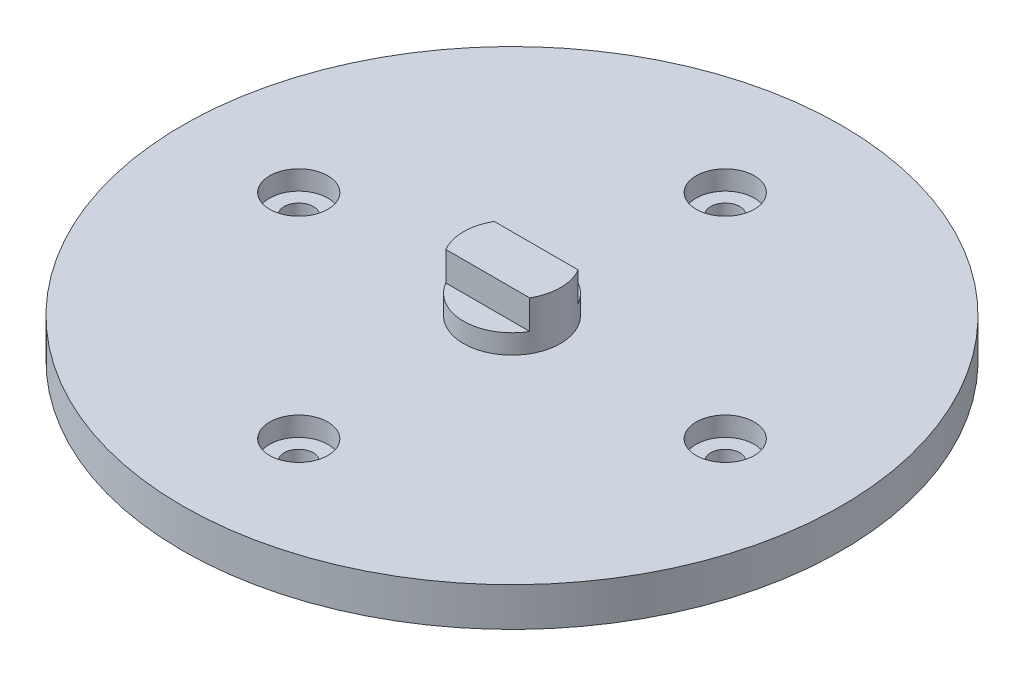
ISO-10303-21;
HEADER;
FILE_DESCRIPTION(('STEP AP214'),'2;1');
FILE_NAME('part.step','',(''),(''),'','','');
FILE_SCHEMA(('AUTOMOTIVE_DESIGN { 1 0 10303 214 1 1 1 1 }'));
ENDSEC;
DATA;
#1=APPLICATION_CONTEXT('core data for automotive mechanical design processes');
#2=APPLICATION_PROTOCOL_DEFINITION('international standard','automotive_design',2000,#1);
#3=PRODUCT_CONTEXT('',#1,'mechanical');
#4=PRODUCT('Part','Part','',(#3));
#5=PRODUCT_RELATED_PRODUCT_CATEGORY('part','',(#4));
#6=PRODUCT_DEFINITION_FORMATION('','',#4);
#7=PRODUCT_DEFINITION_CONTEXT('part definition',#1,'design');
#8=PRODUCT_DEFINITION('design','',#6,#7);
#9=PRODUCT_DEFINITION_SHAPE('','',#8);
#10=(LENGTH_UNIT() NAMED_UNIT(*) SI_UNIT(.MILLI.,.METRE.));
#11=(NAMED_UNIT(*) PLANE_ANGLE_UNIT() SI_UNIT($,.RADIAN.));
#12=(NAMED_UNIT(*) SI_UNIT($,.STERADIAN.) SOLID_ANGLE_UNIT());
#13=UNCERTAINTY_MEASURE_WITH_UNIT(LENGTH_MEASURE(1.E-05),#10,'distance_accuracy_value','');
#14=(GEOMETRIC_REPRESENTATION_CONTEXT(3) GLOBAL_UNCERTAINTY_ASSIGNED_CONTEXT((#13)) GLOBAL_UNIT_ASSIGNED_CONTEXT((#10,
#11,#12)) REPRESENTATION_CONTEXT('',''));
#15=CARTESIAN_POINT('',(0.,0.,0.));
#16=DIRECTION('',(0.,0.,1.));
#17=DIRECTION('',(1.,0.,0.));
#18=AXIS2_PLACEMENT_3D('',#15,#16,#17);
#19=CARTESIAN_POINT('',(0.,6.,0.));
#20=DIRECTION('',(0.,1.,0.));
#21=DIRECTION('',(0.,0.,1.));
#22=AXIS2_PLACEMENT_3D('',#19,#20,#21);
#23=PLANE('',#22);
#24=DIRECTION('',(-1.,0.,0.));
#25=VECTOR('',#24,1.);
#26=CARTESIAN_POINT('',(-4.33012701892219,6.,-2.5));
#27=LINE('',#26,#25);
#28=CARTESIAN_POINT('',(4.33012701892219,6.,-2.5));
#29=VERTEX_POINT('',#28);
#30=CARTESIAN_POINT('',(-4.33012701892219,6.,-2.5));
#31=VERTEX_POINT('',#30);
#32=EDGE_CURVE('E102',#29,#31,#27,.T.);
#33=ORIENTED_EDGE('',*,*,#32,.F.);
#34=CARTESIAN_POINT('',(0.,6.,0.));
#35=DIRECTION('',(0.,1.,0.));
#36=DIRECTION('',(0.,0.,1.));
#37=AXIS2_PLACEMENT_3D('',#34,#35,#36);
#38=CIRCLE('',#37,5.);
#39=EDGE_CURVE('E61',#29,#31,#38,.T.);
#40=ORIENTED_EDGE('',*,*,#39,.T.);
#41=EDGE_LOOP('',(#33,#40));
#42=FACE_BOUND('',#41,.T.);
#43=ADVANCED_FACE('F39',(#42),#23,.T.);
#44=CARTESIAN_POINT('',(0.,4.,-22.));
#45=DIRECTION('',(0.,-1.,0.));
#46=DIRECTION('',(0.,0.,-1.));
#47=AXIS2_PLACEMENT_3D('',#44,#45,#46);
#48=CYLINDRICAL_SURFACE('',#47,3.);
#49=CARTESIAN_POINT('',(0.,2.,-22.));
#50=DIRECTION('',(0.,1.,0.));
#51=DIRECTION('',(0.,0.,1.));
#52=AXIS2_PLACEMENT_3D('',#49,#50,#51);
#53=CIRCLE('',#52,3.);
#54=CARTESIAN_POINT('',(0.,2.,-19.));
#55=VERTEX_POINT('',#54);
#56=EDGE_CURVE('E173',#55,#55,#53,.T.);
#57=ORIENTED_EDGE('',*,*,#56,.F.);
#58=EDGE_LOOP('',(#57));
#59=FACE_BOUND('',#58,.T.);
#60=CARTESIAN_POINT('',(0.,4.,-22.));
#61=DIRECTION('',(0.,1.,0.));
#62=DIRECTION('',(0.,0.,1.));
#63=AXIS2_PLACEMENT_3D('',#60,#61,#62);
#64=CIRCLE('',#63,3.);
#65=CARTESIAN_POINT('',(0.,4.,-19.));
#66=VERTEX_POINT('',#65);
#67=EDGE_CURVE('E165',#66,#66,#64,.T.);
#68=ORIENTED_EDGE('',*,*,#67,.T.);
#69=EDGE_LOOP('',(#68));
#70=FACE_BOUND('',#69,.T.);
#71=ADVANCED_FACE('F240',(#59,#70),#48,.F.);
#72=CARTESIAN_POINT('',(22.,4.,0.));
#73=DIRECTION('',(0.,-1.,0.));
#74=DIRECTION('',(0.,0.,-1.));
#75=AXIS2_PLACEMENT_3D('',#72,#73,#74);
#76=CYLINDRICAL_SURFACE('',#75,3.00000000000006);
#77=CARTESIAN_POINT('',(22.,2.,0.));
#78=DIRECTION('',(0.,1.,0.));
#79=DIRECTION('',(0.,0.,1.));
#80=AXIS2_PLACEMENT_3D('',#77,#78,#79);
#81=CIRCLE('',#80,3.00000000000006);
#82=CARTESIAN_POINT('',(22.,2.,3.00000000000007));
#83=VERTEX_POINT('',#82);
#84=EDGE_CURVE('E180',#83,#83,#81,.T.);
#85=ORIENTED_EDGE('',*,*,#84,.F.);
#86=EDGE_LOOP('',(#85));
#87=FACE_BOUND('',#86,.T.);
#88=CARTESIAN_POINT('',(22.,4.,0.));
#89=DIRECTION('',(0.,1.,0.));
#90=DIRECTION('',(0.,0.,1.));
#91=AXIS2_PLACEMENT_3D('',#88,#89,#90);
#92=CIRCLE('',#91,3.00000000000006);
#93=CARTESIAN_POINT('',(22.,4.,3.00000000000007));
#94=VERTEX_POINT('',#93);
#95=EDGE_CURVE('E161',#94,#94,#92,.T.);
#96=ORIENTED_EDGE('',*,*,#95,.T.);
#97=EDGE_LOOP('',(#96));
#98=FACE_BOUND('',#97,.T.);
#99=ADVANCED_FACE('F192',(#87,#98),#76,.F.);
#100=CARTESIAN_POINT('',(0.,4.,22.));
#101=DIRECTION('',(0.,-1.,0.));
#102=DIRECTION('',(0.,0.,-1.));
#103=AXIS2_PLACEMENT_3D('',#100,#101,#102);
#104=CYLINDRICAL_SURFACE('',#103,3.00000000000016);
#105=CARTESIAN_POINT('',(0.,2.,22.));
#106=DIRECTION('',(0.,1.,0.));
#107=DIRECTION('',(0.,0.,1.));
#108=AXIS2_PLACEMENT_3D('',#105,#106,#107);
#109=CIRCLE('',#108,3.00000000000016);
#110=CARTESIAN_POINT('',(0.,2.,25.0000000000002));
#111=VERTEX_POINT('',#110);
#112=EDGE_CURVE('E48',#111,#111,#109,.T.);
#113=ORIENTED_EDGE('',*,*,#112,.F.);
#114=EDGE_LOOP('',(#113));
#115=FACE_BOUND('',#114,.T.);
#116=CARTESIAN_POINT('',(0.,4.,22.));
#117=DIRECTION('',(0.,1.,0.));
#118=DIRECTION('',(0.,0.,1.));
#119=AXIS2_PLACEMENT_3D('',#116,#117,#118);
#120=CIRCLE('',#119,3.00000000000016);
#121=CARTESIAN_POINT('',(0.,4.,25.0000000000002));
#122=VERTEX_POINT('',#121);
#123=EDGE_CURVE('E157',#122,#122,#120,.T.);
#124=ORIENTED_EDGE('',*,*,#123,.T.);
#125=EDGE_LOOP('',(#124));
#126=FACE_BOUND('',#125,.T.);
#127=ADVANCED_FACE('F189',(#115,#126),#104,.F.);
#128=CARTESIAN_POINT('',(-22.,4.,0.));
#129=DIRECTION('',(0.,-1.,0.));
#130=DIRECTION('',(0.,0.,-1.));
#131=AXIS2_PLACEMENT_3D('',#128,#129,#130);
#132=CYLINDRICAL_SURFACE('',#131,3.00000000000022);
#133=CARTESIAN_POINT('',(-22.,2.,0.));
#134=DIRECTION('',(0.,1.,0.));
#135=DIRECTION('',(0.,0.,1.));
#136=AXIS2_PLACEMENT_3D('',#133,#134,#135);
#137=CIRCLE('',#136,3.00000000000022);
#138=CARTESIAN_POINT('',(-22.,2.,3.00000000000023));
#139=VERTEX_POINT('',#138);
#140=EDGE_CURVE('E11',#139,#139,#137,.T.);
#141=ORIENTED_EDGE('',*,*,#140,.F.);
#142=EDGE_LOOP('',(#141));
#143=FACE_BOUND('',#142,.T.);
#144=CARTESIAN_POINT('',(-22.,4.,0.));
#145=DIRECTION('',(0.,1.,0.));
#146=DIRECTION('',(0.,0.,1.));
#147=AXIS2_PLACEMENT_3D('',#144,#145,#146);
#148=CIRCLE('',#147,3.00000000000022);
#149=CARTESIAN_POINT('',(-22.,4.,3.00000000000023));
#150=VERTEX_POINT('',#149);
#151=EDGE_CURVE('E153',#150,#150,#148,.T.);
#152=ORIENTED_EDGE('',*,*,#151,.T.);
#153=EDGE_LOOP('',(#152));
#154=FACE_BOUND('',#153,.T.);
#155=ADVANCED_FACE('F41',(#143,#154),#132,.F.);
#156=CARTESIAN_POINT('',(0.,4.,0.));
#157=DIRECTION('',(0.,-1.,0.));
#158=DIRECTION('',(0.,0.,-1.));
#159=AXIS2_PLACEMENT_3D('',#156,#157,#158);
#160=CYLINDRICAL_SURFACE('',#159,34.);
#161=CARTESIAN_POINT('',(0.,4.,0.));
#162=DIRECTION('',(0.,1.,0.));
#163=DIRECTION('',(0.,0.,1.));
#164=AXIS2_PLACEMENT_3D('',#161,#162,#163);
#165=CIRCLE('',#164,34.);
#166=CARTESIAN_POINT('',(0.,4.,34.));
#167=VERTEX_POINT('',#166);
#168=EDGE_CURVE('E169',#167,#167,#165,.T.);
#169=ORIENTED_EDGE('',*,*,#168,.F.);
#170=EDGE_LOOP('',(#169));
#171=FACE_BOUND('',#170,.T.);
#172=CARTESIAN_POINT('',(0.,0.,0.));
#173=DIRECTION('',(0.,1.,0.));
#174=DIRECTION('',(0.,0.,1.));
#175=AXIS2_PLACEMENT_3D('',#172,#173,#174);
#176=CIRCLE('',#175,34.);
#177=CARTESIAN_POINT('',(0.,0.,34.));
#178=VERTEX_POINT('',#177);
#179=EDGE_CURVE('E149',#178,#178,#176,.T.);
#180=ORIENTED_EDGE('',*,*,#179,.T.);
#181=EDGE_LOOP('',(#180));
#182=FACE_BOUND('',#181,.T.);
#183=ADVANCED_FACE('F199',(#171,#182),#160,.T.);
#184=CARTESIAN_POINT('',(0.,4.,0.));
#185=DIRECTION('',(0.,1.,0.));
#186=DIRECTION('',(0.,0.,1.));
#187=AXIS2_PLACEMENT_3D('',#184,#185,#186);
#188=PLANE('',#187);
#189=CARTESIAN_POINT('',(0.,4.,0.));
#190=DIRECTION('',(0.,1.,0.));
#191=DIRECTION('',(0.,0.,1.));
#192=AXIS2_PLACEMENT_3D('',#189,#190,#191);
#193=CIRCLE('',#192,5.);
#194=CARTESIAN_POINT('',(0.,4.,5.));
#195=VERTEX_POINT('',#194);
#196=EDGE_CURVE('E108',#195,#195,#193,.T.);
#197=ORIENTED_EDGE('',*,*,#196,.F.);
#198=EDGE_LOOP('',(#197));
#199=FACE_BOUND('',#198,.T.);
#200=ORIENTED_EDGE('',*,*,#151,.F.);
#201=EDGE_LOOP('',(#200));
#202=FACE_BOUND('',#201,.T.);
#203=ORIENTED_EDGE('',*,*,#123,.F.);
#204=EDGE_LOOP('',(#203));
#205=FACE_BOUND('',#204,.T.);
#206=ORIENTED_EDGE('',*,*,#95,.F.);
#207=EDGE_LOOP('',(#206));
#208=FACE_BOUND('',#207,.T.);
#209=ORIENTED_EDGE('',*,*,#67,.F.);
#210=EDGE_LOOP('',(#209));
#211=FACE_BOUND('',#210,.T.);
#212=ORIENTED_EDGE('',*,*,#168,.T.);
#213=EDGE_LOOP('',(#212));
#214=FACE_BOUND('',#213,.T.);
#215=ADVANCED_FACE('F195',(#199,#202,#205,#208,#211,#214),#188,.T.);
#216=CARTESIAN_POINT('',(0.,0.,0.));
#217=DIRECTION('',(0.,1.,0.));
#218=DIRECTION('',(0.,0.,1.));
#219=AXIS2_PLACEMENT_3D('',#216,#217,#218);
#220=PLANE('',#219);
#221=ORIENTED_EDGE('',*,*,#179,.F.);
#222=EDGE_LOOP('',(#221));
#223=FACE_BOUND('',#222,.T.);
#224=CARTESIAN_POINT('',(0.,0.,-22.));
#225=DIRECTION('',(0.,1.,0.));
#226=DIRECTION('',(0.,0.,1.));
#227=AXIS2_PLACEMENT_3D('',#224,#225,#226);
#228=CIRCLE('',#227,1.5);
#229=CARTESIAN_POINT('',(0.,0.,-20.5));
#230=VERTEX_POINT('',#229);
#231=EDGE_CURVE('E141',#230,#230,#228,.T.);
#232=ORIENTED_EDGE('',*,*,#231,.T.);
#233=EDGE_LOOP('',(#232));
#234=FACE_BOUND('',#233,.T.);
#235=CARTESIAN_POINT('',(22.,0.,0.));
#236=DIRECTION('',(0.,1.,0.));
#237=DIRECTION('',(0.,0.,1.));
#238=AXIS2_PLACEMENT_3D('',#235,#236,#237);
#239=CIRCLE('',#238,1.5);
#240=CARTESIAN_POINT('',(22.,0.,1.5));
#241=VERTEX_POINT('',#240);
#242=EDGE_CURVE('E133',#241,#241,#239,.T.);
#243=ORIENTED_EDGE('',*,*,#242,.T.);
#244=EDGE_LOOP('',(#243));
#245=FACE_BOUND('',#244,.T.);
#246=CARTESIAN_POINT('',(0.,0.,22.));
#247=DIRECTION('',(0.,1.,0.));
#248=DIRECTION('',(0.,0.,1.));
#249=AXIS2_PLACEMENT_3D('',#246,#247,#248);
#250=CIRCLE('',#249,1.5);
#251=CARTESIAN_POINT('',(0.,0.,23.5));
#252=VERTEX_POINT('',#251);
#253=EDGE_CURVE('E124',#252,#252,#250,.T.);
#254=ORIENTED_EDGE('',*,*,#253,.T.);
#255=EDGE_LOOP('',(#254));
#256=FACE_BOUND('',#255,.T.);
#257=CARTESIAN_POINT('',(-22.,0.,0.));
#258=DIRECTION('',(0.,1.,0.));
#259=DIRECTION('',(0.,0.,1.));
#260=AXIS2_PLACEMENT_3D('',#257,#258,#259);
#261=CIRCLE('',#260,1.5);
#262=CARTESIAN_POINT('',(-22.,0.,1.5));
#263=VERTEX_POINT('',#262);
#264=EDGE_CURVE('E125',#263,#263,#261,.T.);
#265=ORIENTED_EDGE('',*,*,#264,.T.);
#266=EDGE_LOOP('',(#265));
#267=FACE_BOUND('',#266,.T.);
#268=ADVANCED_FACE('F198',(#223,#234,#245,#256,#267),#220,.F.);
#269=CARTESIAN_POINT('',(0.,2.,-22.));
#270=DIRECTION('',(0.,-1.,0.));
#271=DIRECTION('',(0.,0.,-1.));
#272=AXIS2_PLACEMENT_3D('',#269,#270,#271);
#273=CYLINDRICAL_SURFACE('',#272,1.5);
#274=CARTESIAN_POINT('',(0.,2.,-22.));
#275=DIRECTION('',(0.,1.,0.));
#276=DIRECTION('',(0.,0.,1.));
#277=AXIS2_PLACEMENT_3D('',#274,#275,#276);
#278=CIRCLE('',#277,1.5);
#279=CARTESIAN_POINT('',(0.,2.,-20.5));
#280=VERTEX_POINT('',#279);
#281=EDGE_CURVE('E145',#280,#280,#278,.T.);
#282=ORIENTED_EDGE('',*,*,#281,.T.);
#283=EDGE_LOOP('',(#282));
#284=FACE_BOUND('',#283,.T.);
#285=ORIENTED_EDGE('',*,*,#231,.F.);
#286=EDGE_LOOP('',(#285));
#287=FACE_BOUND('',#286,.T.);
#288=ADVANCED_FACE('F215',(#284,#287),#273,.F.);
#289=CARTESIAN_POINT('',(0.,2.,0.));
#290=DIRECTION('',(0.,1.,0.));
#291=DIRECTION('',(0.,0.,1.));
#292=AXIS2_PLACEMENT_3D('',#289,#290,#291);
#293=PLANE('',#292);
#294=ORIENTED_EDGE('',*,*,#281,.F.);
#295=EDGE_LOOP('',(#294));
#296=FACE_BOUND('',#295,.T.);
#297=ORIENTED_EDGE('',*,*,#56,.T.);
#298=EDGE_LOOP('',(#297));
#299=FACE_BOUND('',#298,.T.);
#300=ADVANCED_FACE('F352',(#296,#299),#293,.T.);
#301=CARTESIAN_POINT('',(22.,2.,0.));
#302=DIRECTION('',(0.,-1.,0.));
#303=DIRECTION('',(0.,0.,-1.));
#304=AXIS2_PLACEMENT_3D('',#301,#302,#303);
#305=CYLINDRICAL_SURFACE('',#304,1.5);
#306=CARTESIAN_POINT('',(22.,2.,0.));
#307=DIRECTION('',(0.,1.,0.));
#308=DIRECTION('',(0.,0.,1.));
#309=AXIS2_PLACEMENT_3D('',#306,#307,#308);
#310=CIRCLE('',#309,1.5);
#311=CARTESIAN_POINT('',(22.,2.,1.5));
#312=VERTEX_POINT('',#311);
#313=EDGE_CURVE('E137',#312,#312,#310,.T.);
#314=ORIENTED_EDGE('',*,*,#313,.T.);
#315=EDGE_LOOP('',(#314));
#316=FACE_BOUND('',#315,.T.);
#317=ORIENTED_EDGE('',*,*,#242,.F.);
#318=EDGE_LOOP('',(#317));
#319=FACE_BOUND('',#318,.T.);
#320=ADVANCED_FACE('F343',(#316,#319),#305,.F.);
#321=CARTESIAN_POINT('',(0.,2.,0.));
#322=DIRECTION('',(0.,1.,0.));
#323=DIRECTION('',(0.,0.,1.));
#324=AXIS2_PLACEMENT_3D('',#321,#322,#323);
#325=PLANE('',#324);
#326=ORIENTED_EDGE('',*,*,#313,.F.);
#327=EDGE_LOOP('',(#326));
#328=FACE_BOUND('',#327,.T.);
#329=ORIENTED_EDGE('',*,*,#84,.T.);
#330=EDGE_LOOP('',(#329));
#331=FACE_BOUND('',#330,.T.);
#332=ADVANCED_FACE('F334',(#328,#331),#325,.T.);
#333=CARTESIAN_POINT('',(0.,2.,22.));
#334=DIRECTION('',(0.,-1.,0.));
#335=DIRECTION('',(0.,0.,-1.));
#336=AXIS2_PLACEMENT_3D('',#333,#334,#335);
#337=CYLINDRICAL_SURFACE('',#336,1.5);
#338=CARTESIAN_POINT('',(0.,2.,22.));
#339=DIRECTION('',(0.,1.,0.));
#340=DIRECTION('',(0.,0.,1.));
#341=AXIS2_PLACEMENT_3D('',#338,#339,#340);
#342=CIRCLE('',#341,1.5);
#343=CARTESIAN_POINT('',(0.,2.,23.5));
#344=VERTEX_POINT('',#343);
#345=EDGE_CURVE('E129',#344,#344,#342,.T.);
#346=ORIENTED_EDGE('',*,*,#345,.T.);
#347=EDGE_LOOP('',(#346));
#348=FACE_BOUND('',#347,.T.);
#349=ORIENTED_EDGE('',*,*,#253,.F.);
#350=EDGE_LOOP('',(#349));
#351=FACE_BOUND('',#350,.T.);
#352=ADVANCED_FACE('F236',(#348,#351),#337,.F.);
#353=CARTESIAN_POINT('',(0.,2.,0.));
#354=DIRECTION('',(0.,1.,0.));
#355=DIRECTION('',(0.,0.,1.));
#356=AXIS2_PLACEMENT_3D('',#353,#354,#355);
#357=PLANE('',#356);
#358=ORIENTED_EDGE('',*,*,#345,.F.);
#359=EDGE_LOOP('',(#358));
#360=FACE_BOUND('',#359,.T.);
#361=ORIENTED_EDGE('',*,*,#112,.T.);
#362=EDGE_LOOP('',(#361));
#363=FACE_BOUND('',#362,.T.);
#364=ADVANCED_FACE('F187',(#360,#363),#357,.T.);
#365=CARTESIAN_POINT('',(-22.,2.,0.));
#366=DIRECTION('',(0.,-1.,0.));
#367=DIRECTION('',(0.,0.,-1.));
#368=AXIS2_PLACEMENT_3D('',#365,#366,#367);
#369=CYLINDRICAL_SURFACE('',#368,1.5);
#370=CARTESIAN_POINT('',(-22.,2.,0.));
#371=DIRECTION('',(0.,1.,0.));
#372=DIRECTION('',(0.,0.,1.));
#373=AXIS2_PLACEMENT_3D('',#370,#371,#372);
#374=CIRCLE('',#373,1.5);
#375=CARTESIAN_POINT('',(-22.,2.,1.5));
#376=VERTEX_POINT('',#375);
#377=EDGE_CURVE('E120',#376,#376,#374,.T.);
#378=ORIENTED_EDGE('',*,*,#377,.T.);
#379=EDGE_LOOP('',(#378));
#380=FACE_BOUND('',#379,.T.);
#381=ORIENTED_EDGE('',*,*,#264,.F.);
#382=EDGE_LOOP('',(#381));
#383=FACE_BOUND('',#382,.T.);
#384=ADVANCED_FACE('F225',(#380,#383),#369,.F.);
#385=CARTESIAN_POINT('',(0.,2.,0.));
#386=DIRECTION('',(0.,1.,0.));
#387=DIRECTION('',(0.,0.,1.));
#388=AXIS2_PLACEMENT_3D('',#385,#386,#387);
#389=PLANE('',#388);
#390=ORIENTED_EDGE('',*,*,#377,.F.);
#391=EDGE_LOOP('',(#390));
#392=FACE_BOUND('',#391,.T.);
#393=ORIENTED_EDGE('',*,*,#140,.T.);
#394=EDGE_LOOP('',(#393));
#395=FACE_BOUND('',#394,.T.);
#396=ADVANCED_FACE('F227',(#392,#395),#389,.T.);
#397=CARTESIAN_POINT('',(0.,6.,0.));
#398=DIRECTION('',(0.,-1.,0.));
#399=DIRECTION('',(0.,0.,-1.));
#400=AXIS2_PLACEMENT_3D('',#397,#398,#399);
#401=CYLINDRICAL_SURFACE('',#400,5.);
#402=ORIENTED_EDGE('',*,*,#39,.F.);
#403=DIRECTION('',(0.,-1.,0.));
#404=VECTOR('',#403,1.);
#405=CARTESIAN_POINT('',(4.33012701892219,9.,-2.5));
#406=LINE('',#405,#404);
#407=CARTESIAN_POINT('',(4.33012701892219,9.,-2.5));
#408=VERTEX_POINT('',#407);
#409=EDGE_CURVE('E114',#408,#29,#406,.T.);
#410=ORIENTED_EDGE('',*,*,#409,.F.);
#411=CARTESIAN_POINT('',(0.,9.,0.));
#412=DIRECTION('',(0.,1.,0.));
#413=DIRECTION('',(0.,0.,1.));
#414=AXIS2_PLACEMENT_3D('',#411,#412,#413);
#415=CIRCLE('',#414,5.);
#416=CARTESIAN_POINT('',(4.33012701892219,9.,2.5));
#417=VERTEX_POINT('',#416);
#418=EDGE_CURVE('E91',#417,#408,#415,.T.);
#419=ORIENTED_EDGE('',*,*,#418,.F.);
#420=DIRECTION('',(0.,-1.,0.));
#421=VECTOR('',#420,1.);
#422=CARTESIAN_POINT('',(4.33012701892219,9.,2.5));
#423=LINE('',#422,#421);
#424=CARTESIAN_POINT('',(4.33012701892219,6.,2.5));
#425=VERTEX_POINT('',#424);
#426=EDGE_CURVE('E87',#417,#425,#423,.T.);
#427=ORIENTED_EDGE('',*,*,#426,.T.);
#428=CARTESIAN_POINT('',(-4.33012701892219,6.,2.5));
#429=VERTEX_POINT('',#428);
#430=EDGE_CURVE('E106',#429,#425,#38,.T.);
#431=ORIENTED_EDGE('',*,*,#430,.F.);
#432=DIRECTION('',(0.,-1.,0.));
#433=VECTOR('',#432,1.);
#434=CARTESIAN_POINT('',(-4.33012701892219,9.,2.5));
#435=LINE('',#434,#433);
#436=CARTESIAN_POINT('',(-4.33012701892219,9.,2.5));
#437=VERTEX_POINT('',#436);
#438=EDGE_CURVE('E85',#437,#429,#435,.T.);
#439=ORIENTED_EDGE('',*,*,#438,.F.);
#440=CARTESIAN_POINT('',(0.,9.,0.));
#441=DIRECTION('',(0.,1.,0.));
#442=DIRECTION('',(0.,0.,1.));
#443=AXIS2_PLACEMENT_3D('',#440,#441,#442);
#444=CIRCLE('',#443,5.);
#445=CARTESIAN_POINT('',(-4.33012701892219,9.,-2.5));
#446=VERTEX_POINT('',#445);
#447=EDGE_CURVE('E92',#446,#437,#444,.T.);
#448=ORIENTED_EDGE('',*,*,#447,.F.);
#449=DIRECTION('',(0.,-1.,0.));
#450=VECTOR('',#449,1.);
#451=CARTESIAN_POINT('',(-4.33012701892219,9.,-2.5));
#452=LINE('',#451,#450);
#453=EDGE_CURVE('E294',#446,#31,#452,.T.);
#454=ORIENTED_EDGE('',*,*,#453,.T.);
#455=EDGE_LOOP('',(#402,#410,#419,#427,#431,#439,#448,#454));
#456=FACE_BOUND('',#455,.T.);
#457=ORIENTED_EDGE('',*,*,#196,.T.);
#458=EDGE_LOOP('',(#457));
#459=FACE_BOUND('',#458,.T.);
#460=ADVANCED_FACE('F104',(#456,#459),#401,.T.);
#461=DIRECTION('',(1.,0.,0.));
#462=VECTOR('',#461,1.);
#463=CARTESIAN_POINT('',(-4.33012701892219,6.,2.5));
#464=LINE('',#463,#462);
#465=EDGE_CURVE('E54',#429,#425,#464,.T.);
#466=ORIENTED_EDGE('',*,*,#465,.F.);
#467=ORIENTED_EDGE('',*,*,#430,.T.);
#468=EDGE_LOOP('',(#466,#467));
#469=FACE_BOUND('',#468,.T.);
#470=ADVANCED_FACE('F242',(#469),#23,.T.);
#471=CARTESIAN_POINT('',(-4.33012701892219,9.,2.5));
#472=DIRECTION('',(0.,0.,-1.));
#473=DIRECTION('',(-1.,0.,0.));
#474=AXIS2_PLACEMENT_3D('',#471,#472,#473);
#475=PLANE('',#474);
#476=ORIENTED_EDGE('',*,*,#465,.T.);
#477=ORIENTED_EDGE('',*,*,#426,.F.);
#478=DIRECTION('',(1.,0.,0.));
#479=VECTOR('',#478,1.);
#480=CARTESIAN_POINT('',(-4.33012701892219,9.,2.5));
#481=LINE('',#480,#479);
#482=EDGE_CURVE('E81',#437,#417,#481,.T.);
#483=ORIENTED_EDGE('',*,*,#482,.F.);
#484=ORIENTED_EDGE('',*,*,#438,.T.);
#485=EDGE_LOOP('',(#476,#477,#483,#484));
#486=FACE_BOUND('',#485,.T.);
#487=ADVANCED_FACE('F83',(#486),#475,.F.);
#488=CARTESIAN_POINT('',(-4.33012701892219,9.,-2.5));
#489=DIRECTION('',(0.,0.,1.));
#490=DIRECTION('',(1.,0.,0.));
#491=AXIS2_PLACEMENT_3D('',#488,#489,#490);
#492=PLANE('',#491);
#493=ORIENTED_EDGE('',*,*,#32,.T.);
#494=ORIENTED_EDGE('',*,*,#453,.F.);
#495=DIRECTION('',(-1.,0.,0.));
#496=VECTOR('',#495,1.);
#497=CARTESIAN_POINT('',(-4.33012701892219,9.,-2.5));
#498=LINE('',#497,#496);
#499=EDGE_CURVE('E97',#408,#446,#498,.T.);
#500=ORIENTED_EDGE('',*,*,#499,.F.);
#501=ORIENTED_EDGE('',*,*,#409,.T.);
#502=EDGE_LOOP('',(#493,#494,#500,#501));
#503=FACE_BOUND('',#502,.T.);
#504=ADVANCED_FACE('F255',(#503),#492,.F.);
#505=CARTESIAN_POINT('',(0.,9.,0.));
#506=DIRECTION('',(0.,1.,0.));
#507=DIRECTION('',(0.,0.,1.));
#508=AXIS2_PLACEMENT_3D('',#505,#506,#507);
#509=PLANE('',#508);
#510=ORIENTED_EDGE('',*,*,#447,.T.);
#511=ORIENTED_EDGE('',*,*,#482,.T.);
#512=ORIENTED_EDGE('',*,*,#418,.T.);
#513=ORIENTED_EDGE('',*,*,#499,.T.);
#514=EDGE_LOOP('',(#510,#511,#512,#513));
#515=FACE_BOUND('',#514,.T.);
#516=ADVANCED_FACE('F95',(#515),#509,.T.);
#517=CLOSED_SHELL('',(#43,#71,#99,#127,#155,#183,#215,#268,#288,#300,#320,#332,#352,#364,#384,
#396,#460,#470,#487,#504,#516));
#518=MANIFOLD_SOLID_BREP('B2',#517);
#519=ADVANCED_BREP_SHAPE_REPRESENTATION('',(#18,#518),#14);
#520=SHAPE_DEFINITION_REPRESENTATION(#9,#519);
ENDSEC;
END-ISO-10303-21;
